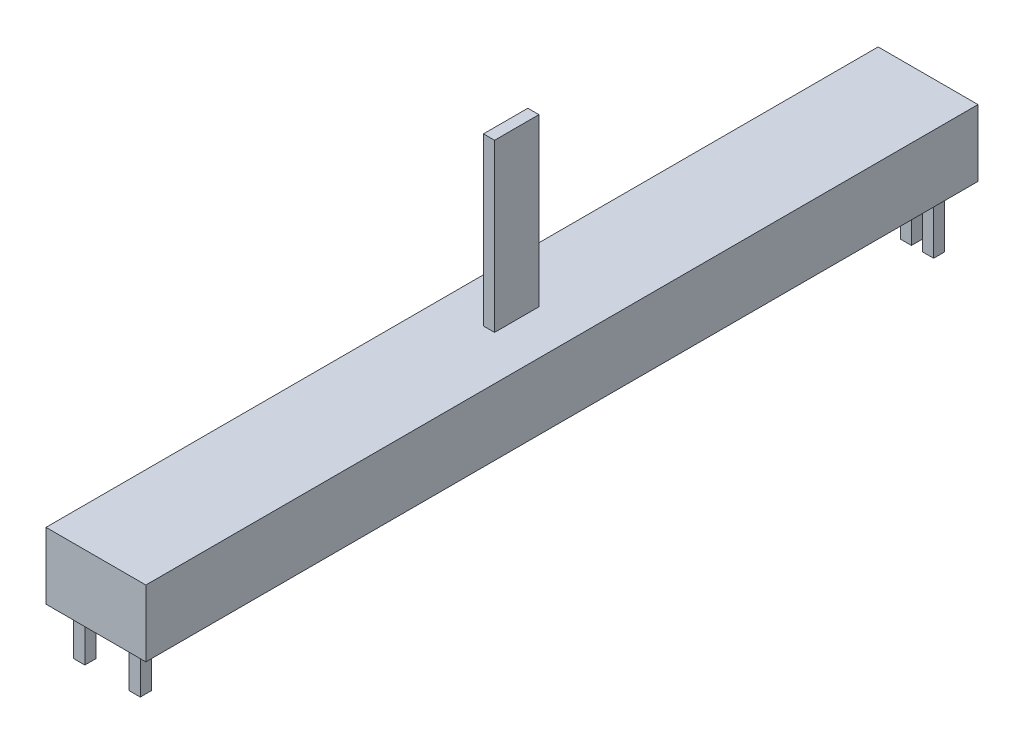
ISO-10303-21;
HEADER;
FILE_DESCRIPTION(('STEP AP214'),'2;1');
FILE_NAME('part.step','',(''),(''),'','','');
FILE_SCHEMA(('AUTOMOTIVE_DESIGN { 1 0 10303 214 1 1 1 1 }'));
ENDSEC;
DATA;
#1=APPLICATION_CONTEXT('core data for automotive mechanical design processes');
#2=APPLICATION_PROTOCOL_DEFINITION('international standard','automotive_design',2000,#1);
#3=PRODUCT_CONTEXT('',#1,'mechanical');
#4=PRODUCT('Part','Part','',(#3));
#5=PRODUCT_RELATED_PRODUCT_CATEGORY('part','',(#4));
#6=PRODUCT_DEFINITION_FORMATION('','',#4);
#7=PRODUCT_DEFINITION_CONTEXT('part definition',#1,'design');
#8=PRODUCT_DEFINITION('design','',#6,#7);
#9=PRODUCT_DEFINITION_SHAPE('','',#8);
#10=(LENGTH_UNIT() NAMED_UNIT(*) SI_UNIT(.MILLI.,.METRE.));
#11=(NAMED_UNIT(*) PLANE_ANGLE_UNIT() SI_UNIT($,.RADIAN.));
#12=(NAMED_UNIT(*) SI_UNIT($,.STERADIAN.) SOLID_ANGLE_UNIT());
#13=UNCERTAINTY_MEASURE_WITH_UNIT(LENGTH_MEASURE(1.E-05),#10,'distance_accuracy_value','');
#14=(GEOMETRIC_REPRESENTATION_CONTEXT(3) GLOBAL_UNCERTAINTY_ASSIGNED_CONTEXT((#13)) GLOBAL_UNIT_ASSIGNED_CONTEXT((#10,
#11,#12)) REPRESENTATION_CONTEXT('',''));
#15=CARTESIAN_POINT('',(0.,0.,0.));
#16=DIRECTION('',(0.,0.,1.));
#17=DIRECTION('',(1.,0.,0.));
#18=AXIS2_PLACEMENT_3D('',#15,#16,#17);
#19=CARTESIAN_POINT('',(0.,0.,0.));
#20=DIRECTION('',(0.,-1.,0.));
#21=DIRECTION('',(0.,0.,-1.));
#22=AXIS2_PLACEMENT_3D('',#19,#20,#21);
#23=PLANE('',#22);
#24=DIRECTION('',(0.,0.,-1.));
#25=VECTOR('',#24,1.);
#26=CARTESIAN_POINT('',(4.5,0.,37.5));
#27=LINE('',#26,#25);
#28=CARTESIAN_POINT('',(4.5,0.,37.5));
#29=VERTEX_POINT('',#28);
#30=CARTESIAN_POINT('',(4.5,0.,-37.5));
#31=VERTEX_POINT('',#30);
#32=EDGE_CURVE('E533',#29,#31,#27,.T.);
#33=ORIENTED_EDGE('',*,*,#32,.F.);
#34=DIRECTION('',(1.,0.,0.));
#35=VECTOR('',#34,1.);
#36=CARTESIAN_POINT('',(-4.5,0.,37.5));
#37=LINE('',#36,#35);
#38=CARTESIAN_POINT('',(-4.5,0.,37.5));
#39=VERTEX_POINT('',#38);
#40=EDGE_CURVE('E539',#39,#29,#37,.T.);
#41=ORIENTED_EDGE('',*,*,#40,.F.);
#42=DIRECTION('',(0.,0.,1.));
#43=VECTOR('',#42,1.);
#44=CARTESIAN_POINT('',(-4.5,0.,37.5));
#45=LINE('',#44,#43);
#46=CARTESIAN_POINT('',(-4.5,0.,-37.5));
#47=VERTEX_POINT('',#46);
#48=EDGE_CURVE('E555',#47,#39,#45,.T.);
#49=ORIENTED_EDGE('',*,*,#48,.F.);
#50=DIRECTION('',(-1.,0.,0.));
#51=VECTOR('',#50,1.);
#52=CARTESIAN_POINT('',(-4.5,0.,-37.5));
#53=LINE('',#52,#51);
#54=EDGE_CURVE('E552',#31,#47,#53,.T.);
#55=ORIENTED_EDGE('',*,*,#54,.F.);
#56=EDGE_LOOP('',(#33,#41,#49,#55));
#57=FACE_BOUND('',#56,.T.);
#58=DIRECTION('',(1.,0.,0.));
#59=VECTOR('',#58,1.);
#60=CARTESIAN_POINT('',(-4.,0.,34.5));
#61=LINE('',#60,#59);
#62=CARTESIAN_POINT('',(-4.,0.,34.5));
#63=VERTEX_POINT('',#62);
#64=CARTESIAN_POINT('',(-3.,0.,34.5));
#65=VERTEX_POINT('',#64);
#66=EDGE_CURVE('E466',#63,#65,#61,.T.);
#67=ORIENTED_EDGE('',*,*,#66,.F.);
#68=DIRECTION('',(0.,0.,-1.));
#69=VECTOR('',#68,1.);
#70=CARTESIAN_POINT('',(-4.,0.,35.5));
#71=LINE('',#70,#69);
#72=CARTESIAN_POINT('',(-4.,0.,35.5));
#73=VERTEX_POINT('',#72);
#74=EDGE_CURVE('E447',#73,#63,#71,.T.);
#75=ORIENTED_EDGE('',*,*,#74,.F.);
#76=DIRECTION('',(-1.,0.,0.));
#77=VECTOR('',#76,1.);
#78=CARTESIAN_POINT('',(-4.,0.,35.5));
#79=LINE('',#78,#77);
#80=CARTESIAN_POINT('',(-3.,0.,35.5));
#81=VERTEX_POINT('',#80);
#82=EDGE_CURVE('E453',#81,#73,#79,.T.);
#83=ORIENTED_EDGE('',*,*,#82,.F.);
#84=DIRECTION('',(0.,0.,1.));
#85=VECTOR('',#84,1.);
#86=CARTESIAN_POINT('',(-3.,0.,35.5));
#87=LINE('',#86,#85);
#88=EDGE_CURVE('E469',#65,#81,#87,.T.);
#89=ORIENTED_EDGE('',*,*,#88,.F.);
#90=EDGE_LOOP('',(#67,#75,#83,#89));
#91=FACE_BOUND('',#90,.T.);
#92=DIRECTION('',(1.,0.,0.));
#93=VECTOR('',#92,1.);
#94=CARTESIAN_POINT('',(1.,0.,34.5));
#95=LINE('',#94,#93);
#96=CARTESIAN_POINT('',(1.,0.,34.5));
#97=VERTEX_POINT('',#96);
#98=CARTESIAN_POINT('',(2.,0.,34.5));
#99=VERTEX_POINT('',#98);
#100=EDGE_CURVE('E425',#97,#99,#95,.T.);
#101=ORIENTED_EDGE('',*,*,#100,.F.);
#102=DIRECTION('',(0.,0.,-1.));
#103=VECTOR('',#102,1.);
#104=CARTESIAN_POINT('',(1.,0.,35.5));
#105=LINE('',#104,#103);
#106=CARTESIAN_POINT('',(1.,0.,35.5));
#107=VERTEX_POINT('',#106);
#108=EDGE_CURVE('E406',#107,#97,#105,.T.);
#109=ORIENTED_EDGE('',*,*,#108,.F.);
#110=DIRECTION('',(-1.,0.,0.));
#111=VECTOR('',#110,1.);
#112=CARTESIAN_POINT('',(1.,0.,35.5));
#113=LINE('',#112,#111);
#114=CARTESIAN_POINT('',(2.,0.,35.5));
#115=VERTEX_POINT('',#114);
#116=EDGE_CURVE('E412',#115,#107,#113,.T.);
#117=ORIENTED_EDGE('',*,*,#116,.F.);
#118=DIRECTION('',(0.,0.,1.));
#119=VECTOR('',#118,1.);
#120=CARTESIAN_POINT('',(2.,0.,35.5));
#121=LINE('',#120,#119);
#122=EDGE_CURVE('E428',#99,#115,#121,.T.);
#123=ORIENTED_EDGE('',*,*,#122,.F.);
#124=EDGE_LOOP('',(#101,#109,#117,#123));
#125=FACE_BOUND('',#124,.T.);
#126=DIRECTION('',(1.,0.,0.));
#127=VECTOR('',#126,1.);
#128=CARTESIAN_POINT('',(-3.5,0.,-35.5));
#129=LINE('',#128,#127);
#130=CARTESIAN_POINT('',(-3.5,0.,-35.5));
#131=VERTEX_POINT('',#130);
#132=CARTESIAN_POINT('',(-2.5,0.,-35.5));
#133=VERTEX_POINT('',#132);
#134=EDGE_CURVE('E384',#131,#133,#129,.T.);
#135=ORIENTED_EDGE('',*,*,#134,.F.);
#136=DIRECTION('',(0.,0.,-1.));
#137=VECTOR('',#136,1.);
#138=CARTESIAN_POINT('',(-3.5,0.,-35.5));
#139=LINE('',#138,#137);
#140=CARTESIAN_POINT('',(-3.5,0.,-34.5));
#141=VERTEX_POINT('',#140);
#142=EDGE_CURVE('E365',#141,#131,#139,.T.);
#143=ORIENTED_EDGE('',*,*,#142,.F.);
#144=DIRECTION('',(-1.,0.,0.));
#145=VECTOR('',#144,1.);
#146=CARTESIAN_POINT('',(-3.5,0.,-34.5));
#147=LINE('',#146,#145);
#148=CARTESIAN_POINT('',(-2.5,0.,-34.5));
#149=VERTEX_POINT('',#148);
#150=EDGE_CURVE('E371',#149,#141,#147,.T.);
#151=ORIENTED_EDGE('',*,*,#150,.F.);
#152=DIRECTION('',(0.,0.,1.));
#153=VECTOR('',#152,1.);
#154=CARTESIAN_POINT('',(-2.5,0.,-35.5));
#155=LINE('',#154,#153);
#156=EDGE_CURVE('E387',#133,#149,#155,.T.);
#157=ORIENTED_EDGE('',*,*,#156,.F.);
#158=EDGE_LOOP('',(#135,#143,#151,#157));
#159=FACE_BOUND('',#158,.T.);
#160=DIRECTION('',(1.,0.,0.));
#161=VECTOR('',#160,1.);
#162=CARTESIAN_POINT('',(-1.5,0.,-35.5));
#163=LINE('',#162,#161);
#164=CARTESIAN_POINT('',(-1.5,0.,-35.5));
#165=VERTEX_POINT('',#164);
#166=CARTESIAN_POINT('',(-0.500000000000002,0.,-35.5));
#167=VERTEX_POINT('',#166);
#168=EDGE_CURVE('E343',#165,#167,#163,.T.);
#169=ORIENTED_EDGE('',*,*,#168,.F.);
#170=DIRECTION('',(0.,0.,-1.));
#171=VECTOR('',#170,1.);
#172=CARTESIAN_POINT('',(-1.5,0.,-35.5));
#173=LINE('',#172,#171);
#174=CARTESIAN_POINT('',(-1.5,0.,-34.5));
#175=VERTEX_POINT('',#174);
#176=EDGE_CURVE('E324',#175,#165,#173,.T.);
#177=ORIENTED_EDGE('',*,*,#176,.F.);
#178=DIRECTION('',(-1.,0.,0.));
#179=VECTOR('',#178,1.);
#180=CARTESIAN_POINT('',(-1.5,0.,-34.5));
#181=LINE('',#180,#179);
#182=CARTESIAN_POINT('',(-0.500000000000002,0.,-34.5));
#183=VERTEX_POINT('',#182);
#184=EDGE_CURVE('E330',#183,#175,#181,.T.);
#185=ORIENTED_EDGE('',*,*,#184,.F.);
#186=DIRECTION('',(0.,0.,1.));
#187=VECTOR('',#186,1.);
#188=CARTESIAN_POINT('',(-0.500000000000002,0.,-35.5));
#189=LINE('',#188,#187);
#190=EDGE_CURVE('E346',#167,#183,#189,.T.);
#191=ORIENTED_EDGE('',*,*,#190,.F.);
#192=EDGE_LOOP('',(#169,#177,#185,#191));
#193=FACE_BOUND('',#192,.T.);
#194=DIRECTION('',(1.,0.,0.));
#195=VECTOR('',#194,1.);
#196=CARTESIAN_POINT('',(0.499999999999999,0.,-35.5));
#197=LINE('',#196,#195);
#198=CARTESIAN_POINT('',(0.499999999999999,0.,-35.5));
#199=VERTEX_POINT('',#198);
#200=CARTESIAN_POINT('',(1.5,0.,-35.5));
#201=VERTEX_POINT('',#200);
#202=EDGE_CURVE('E285',#199,#201,#197,.T.);
#203=ORIENTED_EDGE('',*,*,#202,.F.);
#204=DIRECTION('',(0.,0.,-1.));
#205=VECTOR('',#204,1.);
#206=CARTESIAN_POINT('',(0.499999999999999,0.,-35.5));
#207=LINE('',#206,#205);
#208=CARTESIAN_POINT('',(0.499999999999999,0.,-34.5));
#209=VERTEX_POINT('',#208);
#210=EDGE_CURVE('E280',#209,#199,#207,.T.);
#211=ORIENTED_EDGE('',*,*,#210,.F.);
#212=DIRECTION('',(-1.,0.,0.));
#213=VECTOR('',#212,1.);
#214=CARTESIAN_POINT('',(0.499999999999999,0.,-34.5));
#215=LINE('',#214,#213);
#216=CARTESIAN_POINT('',(1.5,0.,-34.5));
#217=VERTEX_POINT('',#216);
#218=EDGE_CURVE('E295',#217,#209,#215,.T.);
#219=ORIENTED_EDGE('',*,*,#218,.F.);
#220=DIRECTION('',(0.,0.,1.));
#221=VECTOR('',#220,1.);
#222=CARTESIAN_POINT('',(1.5,0.,-35.5));
#223=LINE('',#222,#221);
#224=EDGE_CURVE('E307',#201,#217,#223,.T.);
#225=ORIENTED_EDGE('',*,*,#224,.F.);
#226=EDGE_LOOP('',(#203,#211,#219,#225));
#227=FACE_BOUND('',#226,.T.);
#228=DIRECTION('',(1.,0.,0.));
#229=VECTOR('',#228,1.);
#230=CARTESIAN_POINT('',(2.5,0.,-35.5));
#231=LINE('',#230,#229);
#232=CARTESIAN_POINT('',(2.5,0.,-35.5));
#233=VERTEX_POINT('',#232);
#234=CARTESIAN_POINT('',(3.5,0.,-35.5));
#235=VERTEX_POINT('',#234);
#236=EDGE_CURVE('E999',#233,#235,#231,.T.);
#237=ORIENTED_EDGE('',*,*,#236,.F.);
#238=DIRECTION('',(0.,0.,-1.));
#239=VECTOR('',#238,1.);
#240=CARTESIAN_POINT('',(2.5,0.,-35.5));
#241=LINE('',#240,#239);
#242=CARTESIAN_POINT('',(2.5,0.,-34.5));
#243=VERTEX_POINT('',#242);
#244=EDGE_CURVE('E277',#243,#233,#241,.T.);
#245=ORIENTED_EDGE('',*,*,#244,.F.);
#246=DIRECTION('',(-1.,0.,0.));
#247=VECTOR('',#246,1.);
#248=CARTESIAN_POINT('',(2.5,0.,-34.5));
#249=LINE('',#248,#247);
#250=CARTESIAN_POINT('',(3.5,0.,-34.5));
#251=VERTEX_POINT('',#250);
#252=EDGE_CURVE('E273',#251,#243,#249,.T.);
#253=ORIENTED_EDGE('',*,*,#252,.F.);
#254=DIRECTION('',(0.,0.,1.));
#255=VECTOR('',#254,1.);
#256=CARTESIAN_POINT('',(3.5,0.,-35.5));
#257=LINE('',#256,#255);
#258=EDGE_CURVE('E995',#235,#251,#257,.T.);
#259=ORIENTED_EDGE('',*,*,#258,.F.);
#260=EDGE_LOOP('',(#237,#245,#253,#259));
#261=FACE_BOUND('',#260,.T.);
#262=ADVANCED_FACE('F41',(#57,#91,#125,#159,#193,#227,#261),#23,.T.);
#263=CARTESIAN_POINT('',(0.,6.,0.));
#264=DIRECTION('',(0.,-1.,0.));
#265=DIRECTION('',(0.,0.,-1.));
#266=AXIS2_PLACEMENT_3D('',#263,#264,#265);
#267=PLANE('',#266);
#268=DIRECTION('',(0.,0.,-1.));
#269=VECTOR('',#268,1.);
#270=CARTESIAN_POINT('',(4.5,6.,37.5));
#271=LINE('',#270,#269);
#272=CARTESIAN_POINT('',(4.5,6.,37.5));
#273=VERTEX_POINT('',#272);
#274=CARTESIAN_POINT('',(4.5,6.,-37.5));
#275=VERTEX_POINT('',#274);
#276=EDGE_CURVE('E534',#273,#275,#271,.T.);
#277=ORIENTED_EDGE('',*,*,#276,.T.);
#278=DIRECTION('',(-1.,0.,0.));
#279=VECTOR('',#278,1.);
#280=CARTESIAN_POINT('',(-4.5,6.,-37.5));
#281=LINE('',#280,#279);
#282=CARTESIAN_POINT('',(-4.5,6.,-37.5));
#283=VERTEX_POINT('',#282);
#284=EDGE_CURVE('E538',#275,#283,#281,.T.);
#285=ORIENTED_EDGE('',*,*,#284,.T.);
#286=DIRECTION('',(0.,0.,1.));
#287=VECTOR('',#286,1.);
#288=CARTESIAN_POINT('',(-4.5,6.,37.5));
#289=LINE('',#288,#287);
#290=CARTESIAN_POINT('',(-4.5,6.,37.5));
#291=VERTEX_POINT('',#290);
#292=EDGE_CURVE('E542',#283,#291,#289,.T.);
#293=ORIENTED_EDGE('',*,*,#292,.T.);
#294=DIRECTION('',(1.,0.,0.));
#295=VECTOR('',#294,1.);
#296=CARTESIAN_POINT('',(-4.5,6.,37.5));
#297=LINE('',#296,#295);
#298=EDGE_CURVE('E545',#291,#273,#297,.T.);
#299=ORIENTED_EDGE('',*,*,#298,.T.);
#300=EDGE_LOOP('',(#277,#285,#293,#299));
#301=FACE_BOUND('',#300,.T.);
#302=DIRECTION('',(0.,0.,1.));
#303=VECTOR('',#302,1.);
#304=CARTESIAN_POINT('',(-0.499999999999996,6.,2.07166864621877));
#305=LINE('',#304,#303);
#306=CARTESIAN_POINT('',(-0.499999999999996,6.,-1.92833135378123));
#307=VERTEX_POINT('',#306);
#308=CARTESIAN_POINT('',(-0.499999999999996,6.,2.07166864621877));
#309=VERTEX_POINT('',#308);
#310=EDGE_CURVE('E488',#307,#309,#305,.T.);
#311=ORIENTED_EDGE('',*,*,#310,.F.);
#312=DIRECTION('',(-1.,0.,0.));
#313=VECTOR('',#312,1.);
#314=CARTESIAN_POINT('',(-0.499999999999996,6.,-1.92833135378123));
#315=LINE('',#314,#313);
#316=CARTESIAN_POINT('',(0.500000000000004,6.,-1.92833135378123));
#317=VERTEX_POINT('',#316);
#318=EDGE_CURVE('E494',#317,#307,#315,.T.);
#319=ORIENTED_EDGE('',*,*,#318,.F.);
#320=DIRECTION('',(0.,0.,-1.));
#321=VECTOR('',#320,1.);
#322=CARTESIAN_POINT('',(0.500000000000006,6.,2.07166864621877));
#323=LINE('',#322,#321);
#324=CARTESIAN_POINT('',(0.500000000000006,6.,2.07166864621877));
#325=VERTEX_POINT('',#324);
#326=EDGE_CURVE('E511',#325,#317,#323,.T.);
#327=ORIENTED_EDGE('',*,*,#326,.F.);
#328=DIRECTION('',(1.,0.,0.));
#329=VECTOR('',#328,1.);
#330=CARTESIAN_POINT('',(-0.499999999999996,6.,2.07166864621877));
#331=LINE('',#330,#329);
#332=EDGE_CURVE('E507',#309,#325,#331,.T.);
#333=ORIENTED_EDGE('',*,*,#332,.F.);
#334=EDGE_LOOP('',(#311,#319,#327,#333));
#335=FACE_BOUND('',#334,.T.);
#336=ADVANCED_FACE('F587',(#301,#335),#267,.F.);
#337=CARTESIAN_POINT('',(4.5,6.,37.5));
#338=DIRECTION('',(-1.,0.,0.));
#339=DIRECTION('',(0.,0.,1.));
#340=AXIS2_PLACEMENT_3D('',#337,#338,#339);
#341=PLANE('',#340);
#342=ORIENTED_EDGE('',*,*,#32,.T.);
#343=DIRECTION('',(0.,-1.,0.));
#344=VECTOR('',#343,1.);
#345=CARTESIAN_POINT('',(4.5,6.,-37.5));
#346=LINE('',#345,#344);
#347=EDGE_CURVE('E11',#275,#31,#346,.T.);
#348=ORIENTED_EDGE('',*,*,#347,.F.);
#349=ORIENTED_EDGE('',*,*,#276,.F.);
#350=DIRECTION('',(0.,-1.,0.));
#351=VECTOR('',#350,1.);
#352=CARTESIAN_POINT('',(4.5,6.,37.5));
#353=LINE('',#352,#351);
#354=EDGE_CURVE('E548',#273,#29,#353,.T.);
#355=ORIENTED_EDGE('',*,*,#354,.T.);
#356=EDGE_LOOP('',(#342,#348,#349,#355));
#357=FACE_BOUND('',#356,.T.);
#358=ADVANCED_FACE('F43',(#357),#341,.F.);
#359=CARTESIAN_POINT('',(-4.5,6.,-37.5));
#360=DIRECTION('',(0.,0.,1.));
#361=DIRECTION('',(1.,0.,0.));
#362=AXIS2_PLACEMENT_3D('',#359,#360,#361);
#363=PLANE('',#362);
#364=ORIENTED_EDGE('',*,*,#54,.T.);
#365=DIRECTION('',(0.,-1.,0.));
#366=VECTOR('',#365,1.);
#367=CARTESIAN_POINT('',(-4.5,6.,-37.5));
#368=LINE('',#367,#366);
#369=EDGE_CURVE('E50',#283,#47,#368,.T.);
#370=ORIENTED_EDGE('',*,*,#369,.F.);
#371=ORIENTED_EDGE('',*,*,#284,.F.);
#372=ORIENTED_EDGE('',*,*,#347,.T.);
#373=EDGE_LOOP('',(#364,#370,#371,#372));
#374=FACE_BOUND('',#373,.T.);
#375=ADVANCED_FACE('F589',(#374),#363,.F.);
#376=CARTESIAN_POINT('',(-4.5,6.,37.5));
#377=DIRECTION('',(1.,0.,0.));
#378=DIRECTION('',(0.,0.,-1.));
#379=AXIS2_PLACEMENT_3D('',#376,#377,#378);
#380=PLANE('',#379);
#381=ORIENTED_EDGE('',*,*,#48,.T.);
#382=DIRECTION('',(0.,-1.,0.));
#383=VECTOR('',#382,1.);
#384=CARTESIAN_POINT('',(-4.5,6.,37.5));
#385=LINE('',#384,#383);
#386=EDGE_CURVE('E563',#291,#39,#385,.T.);
#387=ORIENTED_EDGE('',*,*,#386,.F.);
#388=ORIENTED_EDGE('',*,*,#292,.F.);
#389=ORIENTED_EDGE('',*,*,#369,.T.);
#390=EDGE_LOOP('',(#381,#387,#388,#389));
#391=FACE_BOUND('',#390,.T.);
#392=ADVANCED_FACE('F572',(#391),#380,.F.);
#393=CARTESIAN_POINT('',(-4.5,6.,37.5));
#394=DIRECTION('',(0.,0.,-1.));
#395=DIRECTION('',(-1.,0.,0.));
#396=AXIS2_PLACEMENT_3D('',#393,#394,#395);
#397=PLANE('',#396);
#398=ORIENTED_EDGE('',*,*,#40,.T.);
#399=ORIENTED_EDGE('',*,*,#354,.F.);
#400=ORIENTED_EDGE('',*,*,#298,.F.);
#401=ORIENTED_EDGE('',*,*,#386,.T.);
#402=EDGE_LOOP('',(#398,#399,#400,#401));
#403=FACE_BOUND('',#402,.T.);
#404=ADVANCED_FACE('F581',(#403),#397,.F.);
#405=CARTESIAN_POINT('',(-0.499999999999996,21.,2.07166864621877));
#406=DIRECTION('',(1.,0.,0.));
#407=DIRECTION('',(0.,0.,-1.));
#408=AXIS2_PLACEMENT_3D('',#405,#406,#407);
#409=PLANE('',#408);
#410=ORIENTED_EDGE('',*,*,#310,.T.);
#411=DIRECTION('',(0.,-1.,0.));
#412=VECTOR('',#411,1.);
#413=CARTESIAN_POINT('',(-0.499999999999996,21.,2.07166864621877));
#414=LINE('',#413,#412);
#415=CARTESIAN_POINT('',(-0.499999999999996,21.,2.07166864621877));
#416=VERTEX_POINT('',#415);
#417=EDGE_CURVE('E529',#416,#309,#414,.T.);
#418=ORIENTED_EDGE('',*,*,#417,.F.);
#419=DIRECTION('',(0.,0.,1.));
#420=VECTOR('',#419,1.);
#421=CARTESIAN_POINT('',(-0.499999999999996,21.,2.07166864621877));
#422=LINE('',#421,#420);
#423=CARTESIAN_POINT('',(-0.499999999999996,21.,-1.92833135378123));
#424=VERTEX_POINT('',#423);
#425=EDGE_CURVE('E489',#424,#416,#422,.T.);
#426=ORIENTED_EDGE('',*,*,#425,.F.);
#427=DIRECTION('',(0.,-1.,0.));
#428=VECTOR('',#427,1.);
#429=CARTESIAN_POINT('',(-0.499999999999996,21.,-1.92833135378123));
#430=LINE('',#429,#428);
#431=EDGE_CURVE('E503',#424,#307,#430,.T.);
#432=ORIENTED_EDGE('',*,*,#431,.T.);
#433=EDGE_LOOP('',(#410,#418,#426,#432));
#434=FACE_BOUND('',#433,.T.);
#435=ADVANCED_FACE('F605',(#434),#409,.F.);
#436=CARTESIAN_POINT('',(-0.499999999999996,21.,2.07166864621877));
#437=DIRECTION('',(0.,0.,-1.));
#438=DIRECTION('',(-1.,0.,0.));
#439=AXIS2_PLACEMENT_3D('',#436,#437,#438);
#440=PLANE('',#439);
#441=ORIENTED_EDGE('',*,*,#332,.T.);
#442=DIRECTION('',(0.,-1.,0.));
#443=VECTOR('',#442,1.);
#444=CARTESIAN_POINT('',(0.500000000000006,21.,2.07166864621877));
#445=LINE('',#444,#443);
#446=CARTESIAN_POINT('',(0.500000000000006,21.,2.07166864621877));
#447=VERTEX_POINT('',#446);
#448=EDGE_CURVE('E525',#447,#325,#445,.T.);
#449=ORIENTED_EDGE('',*,*,#448,.F.);
#450=DIRECTION('',(1.,0.,0.));
#451=VECTOR('',#450,1.);
#452=CARTESIAN_POINT('',(-0.499999999999996,21.,2.07166864621877));
#453=LINE('',#452,#451);
#454=EDGE_CURVE('E493',#416,#447,#453,.T.);
#455=ORIENTED_EDGE('',*,*,#454,.F.);
#456=ORIENTED_EDGE('',*,*,#417,.T.);
#457=EDGE_LOOP('',(#441,#449,#455,#456));
#458=FACE_BOUND('',#457,.T.);
#459=ADVANCED_FACE('F609',(#458),#440,.F.);
#460=CARTESIAN_POINT('',(0.500000000000006,21.,2.07166864621877));
#461=DIRECTION('',(-1.,0.,0.));
#462=DIRECTION('',(0.,0.,1.));
#463=AXIS2_PLACEMENT_3D('',#460,#461,#462);
#464=PLANE('',#463);
#465=ORIENTED_EDGE('',*,*,#326,.T.);
#466=DIRECTION('',(0.,-1.,0.));
#467=VECTOR('',#466,1.);
#468=CARTESIAN_POINT('',(0.500000000000004,21.,-1.92833135378123));
#469=LINE('',#468,#467);
#470=CARTESIAN_POINT('',(0.500000000000004,21.,-1.92833135378123));
#471=VERTEX_POINT('',#470);
#472=EDGE_CURVE('E521',#471,#317,#469,.T.);
#473=ORIENTED_EDGE('',*,*,#472,.F.);
#474=DIRECTION('',(0.,0.,-1.));
#475=VECTOR('',#474,1.);
#476=CARTESIAN_POINT('',(0.500000000000006,21.,2.07166864621877));
#477=LINE('',#476,#475);
#478=EDGE_CURVE('E497',#447,#471,#477,.T.);
#479=ORIENTED_EDGE('',*,*,#478,.F.);
#480=ORIENTED_EDGE('',*,*,#448,.T.);
#481=EDGE_LOOP('',(#465,#473,#479,#480));
#482=FACE_BOUND('',#481,.T.);
#483=ADVANCED_FACE('F614',(#482),#464,.F.);
#484=CARTESIAN_POINT('',(-0.499999999999996,21.,-1.92833135378123));
#485=DIRECTION('',(0.,0.,1.));
#486=DIRECTION('',(1.,0.,0.));
#487=AXIS2_PLACEMENT_3D('',#484,#485,#486);
#488=PLANE('',#487);
#489=ORIENTED_EDGE('',*,*,#318,.T.);
#490=ORIENTED_EDGE('',*,*,#431,.F.);
#491=DIRECTION('',(-1.,0.,0.));
#492=VECTOR('',#491,1.);
#493=CARTESIAN_POINT('',(-0.499999999999996,21.,-1.92833135378123));
#494=LINE('',#493,#492);
#495=EDGE_CURVE('E500',#471,#424,#494,.T.);
#496=ORIENTED_EDGE('',*,*,#495,.F.);
#497=ORIENTED_EDGE('',*,*,#472,.T.);
#498=EDGE_LOOP('',(#489,#490,#496,#497));
#499=FACE_BOUND('',#498,.T.);
#500=ADVANCED_FACE('F620',(#499),#488,.F.);
#501=CARTESIAN_POINT('',(0.,21.,0.));
#502=DIRECTION('',(0.,-1.,0.));
#503=DIRECTION('',(0.,0.,-1.));
#504=AXIS2_PLACEMENT_3D('',#501,#502,#503);
#505=PLANE('',#504);
#506=ORIENTED_EDGE('',*,*,#425,.T.);
#507=ORIENTED_EDGE('',*,*,#454,.T.);
#508=ORIENTED_EDGE('',*,*,#478,.T.);
#509=ORIENTED_EDGE('',*,*,#495,.T.);
#510=EDGE_LOOP('',(#506,#507,#508,#509));
#511=FACE_BOUND('',#510,.T.);
#512=ADVANCED_FACE('F624',(#511),#505,.F.);
#513=CARTESIAN_POINT('',(-4.,-5.,35.5));
#514=DIRECTION('',(1.,0.,0.));
#515=DIRECTION('',(0.,0.,-1.));
#516=AXIS2_PLACEMENT_3D('',#513,#514,#515);
#517=PLANE('',#516);
#518=ORIENTED_EDGE('',*,*,#74,.T.);
#519=DIRECTION('',(0.,1.,0.));
#520=VECTOR('',#519,1.);
#521=CARTESIAN_POINT('',(-4.,-5.,34.5));
#522=LINE('',#521,#520);
#523=CARTESIAN_POINT('',(-4.,-5.,34.5));
#524=VERTEX_POINT('',#523);
#525=EDGE_CURVE('E485',#524,#63,#522,.T.);
#526=ORIENTED_EDGE('',*,*,#525,.F.);
#527=DIRECTION('',(0.,0.,-1.));
#528=VECTOR('',#527,1.);
#529=CARTESIAN_POINT('',(-4.,-5.,35.5));
#530=LINE('',#529,#528);
#531=CARTESIAN_POINT('',(-4.,-5.,35.5));
#532=VERTEX_POINT('',#531);
#533=EDGE_CURVE('E448',#532,#524,#530,.T.);
#534=ORIENTED_EDGE('',*,*,#533,.F.);
#535=DIRECTION('',(0.,1.,0.));
#536=VECTOR('',#535,1.);
#537=CARTESIAN_POINT('',(-4.,-5.,35.5));
#538=LINE('',#537,#536);
#539=EDGE_CURVE('E462',#532,#73,#538,.T.);
#540=ORIENTED_EDGE('',*,*,#539,.T.);
#541=EDGE_LOOP('',(#518,#526,#534,#540));
#542=FACE_BOUND('',#541,.T.);
#543=ADVANCED_FACE('F628',(#542),#517,.F.);
#544=CARTESIAN_POINT('',(-4.,-5.,34.5));
#545=DIRECTION('',(0.,0.,1.));
#546=DIRECTION('',(1.,0.,0.));
#547=AXIS2_PLACEMENT_3D('',#544,#545,#546);
#548=PLANE('',#547);
#549=ORIENTED_EDGE('',*,*,#66,.T.);
#550=DIRECTION('',(0.,1.,0.));
#551=VECTOR('',#550,1.);
#552=CARTESIAN_POINT('',(-3.,-5.,34.5));
#553=LINE('',#552,#551);
#554=CARTESIAN_POINT('',(-3.,-5.,34.5));
#555=VERTEX_POINT('',#554);
#556=EDGE_CURVE('E481',#555,#65,#553,.T.);
#557=ORIENTED_EDGE('',*,*,#556,.F.);
#558=DIRECTION('',(1.,0.,0.));
#559=VECTOR('',#558,1.);
#560=CARTESIAN_POINT('',(-4.,-5.,34.5));
#561=LINE('',#560,#559);
#562=EDGE_CURVE('E452',#524,#555,#561,.T.);
#563=ORIENTED_EDGE('',*,*,#562,.F.);
#564=ORIENTED_EDGE('',*,*,#525,.T.);
#565=EDGE_LOOP('',(#549,#557,#563,#564));
#566=FACE_BOUND('',#565,.T.);
#567=ADVANCED_FACE('F632',(#566),#548,.F.);
#568=CARTESIAN_POINT('',(-3.,-5.,35.5));
#569=DIRECTION('',(-1.,0.,0.));
#570=DIRECTION('',(0.,0.,1.));
#571=AXIS2_PLACEMENT_3D('',#568,#569,#570);
#572=PLANE('',#571);
#573=ORIENTED_EDGE('',*,*,#88,.T.);
#574=DIRECTION('',(0.,1.,0.));
#575=VECTOR('',#574,1.);
#576=CARTESIAN_POINT('',(-3.,-5.,35.5));
#577=LINE('',#576,#575);
#578=CARTESIAN_POINT('',(-3.,-5.,35.5));
#579=VERTEX_POINT('',#578);
#580=EDGE_CURVE('E478',#579,#81,#577,.T.);
#581=ORIENTED_EDGE('',*,*,#580,.F.);
#582=DIRECTION('',(0.,0.,1.));
#583=VECTOR('',#582,1.);
#584=CARTESIAN_POINT('',(-3.,-5.,35.5));
#585=LINE('',#584,#583);
#586=EDGE_CURVE('E456',#555,#579,#585,.T.);
#587=ORIENTED_EDGE('',*,*,#586,.F.);
#588=ORIENTED_EDGE('',*,*,#556,.T.);
#589=EDGE_LOOP('',(#573,#581,#587,#588));
#590=FACE_BOUND('',#589,.T.);
#591=ADVANCED_FACE('F636',(#590),#572,.F.);
#592=CARTESIAN_POINT('',(-4.,-5.,35.5));
#593=DIRECTION('',(0.,0.,-1.));
#594=DIRECTION('',(-1.,0.,0.));
#595=AXIS2_PLACEMENT_3D('',#592,#593,#594);
#596=PLANE('',#595);
#597=ORIENTED_EDGE('',*,*,#82,.T.);
#598=ORIENTED_EDGE('',*,*,#539,.F.);
#599=DIRECTION('',(-1.,0.,0.));
#600=VECTOR('',#599,1.);
#601=CARTESIAN_POINT('',(-4.,-5.,35.5));
#602=LINE('',#601,#600);
#603=EDGE_CURVE('E459',#579,#532,#602,.T.);
#604=ORIENTED_EDGE('',*,*,#603,.F.);
#605=ORIENTED_EDGE('',*,*,#580,.T.);
#606=EDGE_LOOP('',(#597,#598,#604,#605));
#607=FACE_BOUND('',#606,.T.);
#608=ADVANCED_FACE('F640',(#607),#596,.F.);
#609=CARTESIAN_POINT('',(0.,-5.,0.));
#610=DIRECTION('',(0.,-1.,0.));
#611=DIRECTION('',(0.,0.,-1.));
#612=AXIS2_PLACEMENT_3D('',#609,#610,#611);
#613=PLANE('',#612);
#614=ORIENTED_EDGE('',*,*,#533,.T.);
#615=ORIENTED_EDGE('',*,*,#562,.T.);
#616=ORIENTED_EDGE('',*,*,#586,.T.);
#617=ORIENTED_EDGE('',*,*,#603,.T.);
#618=EDGE_LOOP('',(#614,#615,#616,#617));
#619=FACE_BOUND('',#618,.T.);
#620=ADVANCED_FACE('F644',(#619),#613,.T.);
#621=CARTESIAN_POINT('',(1.,-5.,35.5));
#622=DIRECTION('',(1.,0.,0.));
#623=DIRECTION('',(0.,0.,-1.));
#624=AXIS2_PLACEMENT_3D('',#621,#622,#623);
#625=PLANE('',#624);
#626=ORIENTED_EDGE('',*,*,#108,.T.);
#627=DIRECTION('',(0.,1.,0.));
#628=VECTOR('',#627,1.);
#629=CARTESIAN_POINT('',(1.,-5.,34.5));
#630=LINE('',#629,#628);
#631=CARTESIAN_POINT('',(1.,-5.,34.5));
#632=VERTEX_POINT('',#631);
#633=EDGE_CURVE('E444',#632,#97,#630,.T.);
#634=ORIENTED_EDGE('',*,*,#633,.F.);
#635=DIRECTION('',(0.,0.,-1.));
#636=VECTOR('',#635,1.);
#637=CARTESIAN_POINT('',(1.,-5.,35.5));
#638=LINE('',#637,#636);
#639=CARTESIAN_POINT('',(1.,-5.,35.5));
#640=VERTEX_POINT('',#639);
#641=EDGE_CURVE('E407',#640,#632,#638,.T.);
#642=ORIENTED_EDGE('',*,*,#641,.F.);
#643=DIRECTION('',(0.,1.,0.));
#644=VECTOR('',#643,1.);
#645=CARTESIAN_POINT('',(1.,-5.,35.5));
#646=LINE('',#645,#644);
#647=EDGE_CURVE('E421',#640,#107,#646,.T.);
#648=ORIENTED_EDGE('',*,*,#647,.T.);
#649=EDGE_LOOP('',(#626,#634,#642,#648));
#650=FACE_BOUND('',#649,.T.);
#651=ADVANCED_FACE('F648',(#650),#625,.F.);
#652=CARTESIAN_POINT('',(1.,-5.,34.5));
#653=DIRECTION('',(0.,0.,1.));
#654=DIRECTION('',(1.,0.,0.));
#655=AXIS2_PLACEMENT_3D('',#652,#653,#654);
#656=PLANE('',#655);
#657=ORIENTED_EDGE('',*,*,#100,.T.);
#658=DIRECTION('',(0.,1.,0.));
#659=VECTOR('',#658,1.);
#660=CARTESIAN_POINT('',(2.,-5.,34.5));
#661=LINE('',#660,#659);
#662=CARTESIAN_POINT('',(2.,-5.,34.5));
#663=VERTEX_POINT('',#662);
#664=EDGE_CURVE('E440',#663,#99,#661,.T.);
#665=ORIENTED_EDGE('',*,*,#664,.F.);
#666=DIRECTION('',(1.,0.,0.));
#667=VECTOR('',#666,1.);
#668=CARTESIAN_POINT('',(1.,-5.,34.5));
#669=LINE('',#668,#667);
#670=EDGE_CURVE('E411',#632,#663,#669,.T.);
#671=ORIENTED_EDGE('',*,*,#670,.F.);
#672=ORIENTED_EDGE('',*,*,#633,.T.);
#673=EDGE_LOOP('',(#657,#665,#671,#672));
#674=FACE_BOUND('',#673,.T.);
#675=ADVANCED_FACE('F652',(#674),#656,.F.);
#676=CARTESIAN_POINT('',(2.,-5.,35.5));
#677=DIRECTION('',(-1.,0.,0.));
#678=DIRECTION('',(0.,0.,1.));
#679=AXIS2_PLACEMENT_3D('',#676,#677,#678);
#680=PLANE('',#679);
#681=ORIENTED_EDGE('',*,*,#122,.T.);
#682=DIRECTION('',(0.,1.,0.));
#683=VECTOR('',#682,1.);
#684=CARTESIAN_POINT('',(2.,-5.,35.5));
#685=LINE('',#684,#683);
#686=CARTESIAN_POINT('',(2.,-5.,35.5));
#687=VERTEX_POINT('',#686);
#688=EDGE_CURVE('E437',#687,#115,#685,.T.);
#689=ORIENTED_EDGE('',*,*,#688,.F.);
#690=DIRECTION('',(0.,0.,1.));
#691=VECTOR('',#690,1.);
#692=CARTESIAN_POINT('',(2.,-5.,35.5));
#693=LINE('',#692,#691);
#694=EDGE_CURVE('E415',#663,#687,#693,.T.);
#695=ORIENTED_EDGE('',*,*,#694,.F.);
#696=ORIENTED_EDGE('',*,*,#664,.T.);
#697=EDGE_LOOP('',(#681,#689,#695,#696));
#698=FACE_BOUND('',#697,.T.);
#699=ADVANCED_FACE('F656',(#698),#680,.F.);
#700=CARTESIAN_POINT('',(1.,-5.,35.5));
#701=DIRECTION('',(0.,0.,-1.));
#702=DIRECTION('',(-1.,0.,0.));
#703=AXIS2_PLACEMENT_3D('',#700,#701,#702);
#704=PLANE('',#703);
#705=ORIENTED_EDGE('',*,*,#116,.T.);
#706=ORIENTED_EDGE('',*,*,#647,.F.);
#707=DIRECTION('',(-1.,0.,0.));
#708=VECTOR('',#707,1.);
#709=CARTESIAN_POINT('',(1.,-5.,35.5));
#710=LINE('',#709,#708);
#711=EDGE_CURVE('E418',#687,#640,#710,.T.);
#712=ORIENTED_EDGE('',*,*,#711,.F.);
#713=ORIENTED_EDGE('',*,*,#688,.T.);
#714=EDGE_LOOP('',(#705,#706,#712,#713));
#715=FACE_BOUND('',#714,.T.);
#716=ADVANCED_FACE('F660',(#715),#704,.F.);
#717=CARTESIAN_POINT('',(0.,-5.,0.));
#718=DIRECTION('',(0.,-1.,0.));
#719=DIRECTION('',(0.,0.,-1.));
#720=AXIS2_PLACEMENT_3D('',#717,#718,#719);
#721=PLANE('',#720);
#722=ORIENTED_EDGE('',*,*,#641,.T.);
#723=ORIENTED_EDGE('',*,*,#670,.T.);
#724=ORIENTED_EDGE('',*,*,#694,.T.);
#725=ORIENTED_EDGE('',*,*,#711,.T.);
#726=EDGE_LOOP('',(#722,#723,#724,#725));
#727=FACE_BOUND('',#726,.T.);
#728=ADVANCED_FACE('F664',(#727),#721,.T.);
#729=CARTESIAN_POINT('',(-3.5,-5.,-35.5));
#730=DIRECTION('',(1.,0.,0.));
#731=DIRECTION('',(0.,0.,-1.));
#732=AXIS2_PLACEMENT_3D('',#729,#730,#731);
#733=PLANE('',#732);
#734=ORIENTED_EDGE('',*,*,#142,.T.);
#735=DIRECTION('',(0.,1.,0.));
#736=VECTOR('',#735,1.);
#737=CARTESIAN_POINT('',(-3.5,-5.,-35.5));
#738=LINE('',#737,#736);
#739=CARTESIAN_POINT('',(-3.5,-5.,-35.5));
#740=VERTEX_POINT('',#739);
#741=EDGE_CURVE('E403',#740,#131,#738,.T.);
#742=ORIENTED_EDGE('',*,*,#741,.F.);
#743=DIRECTION('',(0.,0.,-1.));
#744=VECTOR('',#743,1.);
#745=CARTESIAN_POINT('',(-3.5,-5.,-35.5));
#746=LINE('',#745,#744);
#747=CARTESIAN_POINT('',(-3.5,-5.,-34.5));
#748=VERTEX_POINT('',#747);
#749=EDGE_CURVE('E366',#748,#740,#746,.T.);
#750=ORIENTED_EDGE('',*,*,#749,.F.);
#751=DIRECTION('',(0.,1.,0.));
#752=VECTOR('',#751,1.);
#753=CARTESIAN_POINT('',(-3.5,-5.,-34.5));
#754=LINE('',#753,#752);
#755=EDGE_CURVE('E380',#748,#141,#754,.T.);
#756=ORIENTED_EDGE('',*,*,#755,.T.);
#757=EDGE_LOOP('',(#734,#742,#750,#756));
#758=FACE_BOUND('',#757,.T.);
#759=ADVANCED_FACE('F668',(#758),#733,.F.);
#760=CARTESIAN_POINT('',(-3.5,-5.,-35.5));
#761=DIRECTION('',(0.,0.,1.));
#762=DIRECTION('',(1.,0.,0.));
#763=AXIS2_PLACEMENT_3D('',#760,#761,#762);
#764=PLANE('',#763);
#765=ORIENTED_EDGE('',*,*,#134,.T.);
#766=DIRECTION('',(0.,1.,0.));
#767=VECTOR('',#766,1.);
#768=CARTESIAN_POINT('',(-2.5,-5.,-35.5));
#769=LINE('',#768,#767);
#770=CARTESIAN_POINT('',(-2.5,-5.,-35.5));
#771=VERTEX_POINT('',#770);
#772=EDGE_CURVE('E399',#771,#133,#769,.T.);
#773=ORIENTED_EDGE('',*,*,#772,.F.);
#774=DIRECTION('',(1.,0.,0.));
#775=VECTOR('',#774,1.);
#776=CARTESIAN_POINT('',(-3.5,-5.,-35.5));
#777=LINE('',#776,#775);
#778=EDGE_CURVE('E370',#740,#771,#777,.T.);
#779=ORIENTED_EDGE('',*,*,#778,.F.);
#780=ORIENTED_EDGE('',*,*,#741,.T.);
#781=EDGE_LOOP('',(#765,#773,#779,#780));
#782=FACE_BOUND('',#781,.T.);
#783=ADVANCED_FACE('F672',(#782),#764,.F.);
#784=CARTESIAN_POINT('',(-2.5,-5.,-35.5));
#785=DIRECTION('',(-1.,0.,0.));
#786=DIRECTION('',(0.,0.,1.));
#787=AXIS2_PLACEMENT_3D('',#784,#785,#786);
#788=PLANE('',#787);
#789=ORIENTED_EDGE('',*,*,#156,.T.);
#790=DIRECTION('',(0.,1.,0.));
#791=VECTOR('',#790,1.);
#792=CARTESIAN_POINT('',(-2.5,-5.,-34.5));
#793=LINE('',#792,#791);
#794=CARTESIAN_POINT('',(-2.5,-5.,-34.5));
#795=VERTEX_POINT('',#794);
#796=EDGE_CURVE('E396',#795,#149,#793,.T.);
#797=ORIENTED_EDGE('',*,*,#796,.F.);
#798=DIRECTION('',(0.,0.,1.));
#799=VECTOR('',#798,1.);
#800=CARTESIAN_POINT('',(-2.5,-5.,-35.5));
#801=LINE('',#800,#799);
#802=EDGE_CURVE('E374',#771,#795,#801,.T.);
#803=ORIENTED_EDGE('',*,*,#802,.F.);
#804=ORIENTED_EDGE('',*,*,#772,.T.);
#805=EDGE_LOOP('',(#789,#797,#803,#804));
#806=FACE_BOUND('',#805,.T.);
#807=ADVANCED_FACE('F676',(#806),#788,.F.);
#808=CARTESIAN_POINT('',(-3.5,-5.,-34.5));
#809=DIRECTION('',(0.,0.,-1.));
#810=DIRECTION('',(-1.,0.,0.));
#811=AXIS2_PLACEMENT_3D('',#808,#809,#810);
#812=PLANE('',#811);
#813=ORIENTED_EDGE('',*,*,#150,.T.);
#814=ORIENTED_EDGE('',*,*,#755,.F.);
#815=DIRECTION('',(-1.,0.,0.));
#816=VECTOR('',#815,1.);
#817=CARTESIAN_POINT('',(-3.5,-5.,-34.5));
#818=LINE('',#817,#816);
#819=EDGE_CURVE('E377',#795,#748,#818,.T.);
#820=ORIENTED_EDGE('',*,*,#819,.F.);
#821=ORIENTED_EDGE('',*,*,#796,.T.);
#822=EDGE_LOOP('',(#813,#814,#820,#821));
#823=FACE_BOUND('',#822,.T.);
#824=ADVANCED_FACE('F680',(#823),#812,.F.);
#825=CARTESIAN_POINT('',(0.,-5.,0.));
#826=DIRECTION('',(0.,1.,0.));
#827=DIRECTION('',(0.,0.,1.));
#828=AXIS2_PLACEMENT_3D('',#825,#826,#827);
#829=PLANE('',#828);
#830=ORIENTED_EDGE('',*,*,#749,.T.);
#831=ORIENTED_EDGE('',*,*,#778,.T.);
#832=ORIENTED_EDGE('',*,*,#802,.T.);
#833=ORIENTED_EDGE('',*,*,#819,.T.);
#834=EDGE_LOOP('',(#830,#831,#832,#833));
#835=FACE_BOUND('',#834,.T.);
#836=ADVANCED_FACE('F684',(#835),#829,.F.);
#837=CARTESIAN_POINT('',(-1.5,-5.,-35.5));
#838=DIRECTION('',(1.,0.,0.));
#839=DIRECTION('',(0.,0.,-1.));
#840=AXIS2_PLACEMENT_3D('',#837,#838,#839);
#841=PLANE('',#840);
#842=ORIENTED_EDGE('',*,*,#176,.T.);
#843=DIRECTION('',(0.,1.,0.));
#844=VECTOR('',#843,1.);
#845=CARTESIAN_POINT('',(-1.5,-5.,-35.5));
#846=LINE('',#845,#844);
#847=CARTESIAN_POINT('',(-1.5,-5.,-35.5));
#848=VERTEX_POINT('',#847);
#849=EDGE_CURVE('E362',#848,#165,#846,.T.);
#850=ORIENTED_EDGE('',*,*,#849,.F.);
#851=DIRECTION('',(0.,0.,-1.));
#852=VECTOR('',#851,1.);
#853=CARTESIAN_POINT('',(-1.5,-5.,-35.5));
#854=LINE('',#853,#852);
#855=CARTESIAN_POINT('',(-1.5,-5.,-34.5));
#856=VERTEX_POINT('',#855);
#857=EDGE_CURVE('E325',#856,#848,#854,.T.);
#858=ORIENTED_EDGE('',*,*,#857,.F.);
#859=DIRECTION('',(0.,1.,0.));
#860=VECTOR('',#859,1.);
#861=CARTESIAN_POINT('',(-1.5,-5.,-34.5));
#862=LINE('',#861,#860);
#863=EDGE_CURVE('E339',#856,#175,#862,.T.);
#864=ORIENTED_EDGE('',*,*,#863,.T.);
#865=EDGE_LOOP('',(#842,#850,#858,#864));
#866=FACE_BOUND('',#865,.T.);
#867=ADVANCED_FACE('F688',(#866),#841,.F.);
#868=CARTESIAN_POINT('',(-1.5,-5.,-35.5));
#869=DIRECTION('',(0.,0.,1.));
#870=DIRECTION('',(1.,0.,0.));
#871=AXIS2_PLACEMENT_3D('',#868,#869,#870);
#872=PLANE('',#871);
#873=ORIENTED_EDGE('',*,*,#168,.T.);
#874=DIRECTION('',(0.,1.,0.));
#875=VECTOR('',#874,1.);
#876=CARTESIAN_POINT('',(-0.500000000000002,-5.,-35.5));
#877=LINE('',#876,#875);
#878=CARTESIAN_POINT('',(-0.500000000000002,-5.,-35.5));
#879=VERTEX_POINT('',#878);
#880=EDGE_CURVE('E358',#879,#167,#877,.T.);
#881=ORIENTED_EDGE('',*,*,#880,.F.);
#882=DIRECTION('',(1.,0.,0.));
#883=VECTOR('',#882,1.);
#884=CARTESIAN_POINT('',(-1.5,-5.,-35.5));
#885=LINE('',#884,#883);
#886=EDGE_CURVE('E329',#848,#879,#885,.T.);
#887=ORIENTED_EDGE('',*,*,#886,.F.);
#888=ORIENTED_EDGE('',*,*,#849,.T.);
#889=EDGE_LOOP('',(#873,#881,#887,#888));
#890=FACE_BOUND('',#889,.T.);
#891=ADVANCED_FACE('F692',(#890),#872,.F.);
#892=CARTESIAN_POINT('',(-0.500000000000002,-5.,-35.5));
#893=DIRECTION('',(-1.,0.,0.));
#894=DIRECTION('',(0.,0.,1.));
#895=AXIS2_PLACEMENT_3D('',#892,#893,#894);
#896=PLANE('',#895);
#897=ORIENTED_EDGE('',*,*,#190,.T.);
#898=DIRECTION('',(0.,1.,0.));
#899=VECTOR('',#898,1.);
#900=CARTESIAN_POINT('',(-0.500000000000002,-5.,-34.5));
#901=LINE('',#900,#899);
#902=CARTESIAN_POINT('',(-0.500000000000002,-5.,-34.5));
#903=VERTEX_POINT('',#902);
#904=EDGE_CURVE('E355',#903,#183,#901,.T.);
#905=ORIENTED_EDGE('',*,*,#904,.F.);
#906=DIRECTION('',(0.,0.,1.));
#907=VECTOR('',#906,1.);
#908=CARTESIAN_POINT('',(-0.500000000000002,-5.,-35.5));
#909=LINE('',#908,#907);
#910=EDGE_CURVE('E333',#879,#903,#909,.T.);
#911=ORIENTED_EDGE('',*,*,#910,.F.);
#912=ORIENTED_EDGE('',*,*,#880,.T.);
#913=EDGE_LOOP('',(#897,#905,#911,#912));
#914=FACE_BOUND('',#913,.T.);
#915=ADVANCED_FACE('F696',(#914),#896,.F.);
#916=CARTESIAN_POINT('',(-1.5,-5.,-34.5));
#917=DIRECTION('',(0.,0.,-1.));
#918=DIRECTION('',(-1.,0.,0.));
#919=AXIS2_PLACEMENT_3D('',#916,#917,#918);
#920=PLANE('',#919);
#921=ORIENTED_EDGE('',*,*,#184,.T.);
#922=ORIENTED_EDGE('',*,*,#863,.F.);
#923=DIRECTION('',(-1.,0.,0.));
#924=VECTOR('',#923,1.);
#925=CARTESIAN_POINT('',(-1.5,-5.,-34.5));
#926=LINE('',#925,#924);
#927=EDGE_CURVE('E336',#903,#856,#926,.T.);
#928=ORIENTED_EDGE('',*,*,#927,.F.);
#929=ORIENTED_EDGE('',*,*,#904,.T.);
#930=EDGE_LOOP('',(#921,#922,#928,#929));
#931=FACE_BOUND('',#930,.T.);
#932=ADVANCED_FACE('F700',(#931),#920,.F.);
#933=CARTESIAN_POINT('',(0.,-5.,0.));
#934=DIRECTION('',(0.,1.,0.));
#935=DIRECTION('',(0.,0.,1.));
#936=AXIS2_PLACEMENT_3D('',#933,#934,#935);
#937=PLANE('',#936);
#938=ORIENTED_EDGE('',*,*,#857,.T.);
#939=ORIENTED_EDGE('',*,*,#886,.T.);
#940=ORIENTED_EDGE('',*,*,#910,.T.);
#941=ORIENTED_EDGE('',*,*,#927,.T.);
#942=EDGE_LOOP('',(#938,#939,#940,#941));
#943=FACE_BOUND('',#942,.T.);
#944=ADVANCED_FACE('F704',(#943),#937,.F.);
#945=CARTESIAN_POINT('',(0.499999999999999,-5.,-35.5));
#946=DIRECTION('',(1.,0.,0.));
#947=DIRECTION('',(0.,0.,-1.));
#948=AXIS2_PLACEMENT_3D('',#945,#946,#947);
#949=PLANE('',#948);
#950=ORIENTED_EDGE('',*,*,#210,.T.);
#951=DIRECTION('',(0.,1.,0.));
#952=VECTOR('',#951,1.);
#953=CARTESIAN_POINT('',(0.499999999999999,-5.,-35.5));
#954=LINE('',#953,#952);
#955=CARTESIAN_POINT('',(0.499999999999999,-5.,-35.5));
#956=VERTEX_POINT('',#955);
#957=EDGE_CURVE('E321',#956,#199,#954,.T.);
#958=ORIENTED_EDGE('',*,*,#957,.F.);
#959=DIRECTION('',(0.,0.,-1.));
#960=VECTOR('',#959,1.);
#961=CARTESIAN_POINT('',(0.499999999999999,-5.,-35.5));
#962=LINE('',#961,#960);
#963=CARTESIAN_POINT('',(0.499999999999999,-5.,-34.5));
#964=VERTEX_POINT('',#963);
#965=EDGE_CURVE('E290',#964,#956,#962,.T.);
#966=ORIENTED_EDGE('',*,*,#965,.F.);
#967=DIRECTION('',(0.,1.,0.));
#968=VECTOR('',#967,1.);
#969=CARTESIAN_POINT('',(0.499999999999999,-5.,-34.5));
#970=LINE('',#969,#968);
#971=EDGE_CURVE('E303',#964,#209,#970,.T.);
#972=ORIENTED_EDGE('',*,*,#971,.T.);
#973=EDGE_LOOP('',(#950,#958,#966,#972));
#974=FACE_BOUND('',#973,.T.);
#975=ADVANCED_FACE('F708',(#974),#949,.F.);
#976=CARTESIAN_POINT('',(0.499999999999999,-5.,-35.5));
#977=DIRECTION('',(0.,0.,1.));
#978=DIRECTION('',(1.,0.,0.));
#979=AXIS2_PLACEMENT_3D('',#976,#977,#978);
#980=PLANE('',#979);
#981=ORIENTED_EDGE('',*,*,#202,.T.);
#982=DIRECTION('',(0.,1.,0.));
#983=VECTOR('',#982,1.);
#984=CARTESIAN_POINT('',(1.5,-5.,-35.5));
#985=LINE('',#984,#983);
#986=CARTESIAN_POINT('',(1.5,-5.,-35.5));
#987=VERTEX_POINT('',#986);
#988=EDGE_CURVE('E317',#987,#201,#985,.T.);
#989=ORIENTED_EDGE('',*,*,#988,.F.);
#990=DIRECTION('',(1.,0.,0.));
#991=VECTOR('',#990,1.);
#992=CARTESIAN_POINT('',(0.499999999999999,-5.,-35.5));
#993=LINE('',#992,#991);
#994=EDGE_CURVE('E294',#956,#987,#993,.T.);
#995=ORIENTED_EDGE('',*,*,#994,.F.);
#996=ORIENTED_EDGE('',*,*,#957,.T.);
#997=EDGE_LOOP('',(#981,#989,#995,#996));
#998=FACE_BOUND('',#997,.T.);
#999=ADVANCED_FACE('F712',(#998),#980,.F.);
#1000=CARTESIAN_POINT('',(1.5,-5.,-35.5));
#1001=DIRECTION('',(-1.,0.,0.));
#1002=DIRECTION('',(0.,0.,1.));
#1003=AXIS2_PLACEMENT_3D('',#1000,#1001,#1002);
#1004=PLANE('',#1003);
#1005=ORIENTED_EDGE('',*,*,#224,.T.);
#1006=DIRECTION('',(0.,1.,0.));
#1007=VECTOR('',#1006,1.);
#1008=CARTESIAN_POINT('',(1.5,-5.,-34.5));
#1009=LINE('',#1008,#1007);
#1010=CARTESIAN_POINT('',(1.5,-5.,-34.5));
#1011=VERTEX_POINT('',#1010);
#1012=EDGE_CURVE('E65',#1011,#217,#1009,.T.);
#1013=ORIENTED_EDGE('',*,*,#1012,.F.);
#1014=DIRECTION('',(0.,0.,1.));
#1015=VECTOR('',#1014,1.);
#1016=CARTESIAN_POINT('',(1.5,-5.,-35.5));
#1017=LINE('',#1016,#1015);
#1018=EDGE_CURVE('E298',#987,#1011,#1017,.T.);
#1019=ORIENTED_EDGE('',*,*,#1018,.F.);
#1020=ORIENTED_EDGE('',*,*,#988,.T.);
#1021=EDGE_LOOP('',(#1005,#1013,#1019,#1020));
#1022=FACE_BOUND('',#1021,.T.);
#1023=ADVANCED_FACE('F716',(#1022),#1004,.F.);
#1024=CARTESIAN_POINT('',(0.499999999999999,-5.,-34.5));
#1025=DIRECTION('',(0.,0.,-1.));
#1026=DIRECTION('',(-1.,0.,0.));
#1027=AXIS2_PLACEMENT_3D('',#1024,#1025,#1026);
#1028=PLANE('',#1027);
#1029=ORIENTED_EDGE('',*,*,#218,.T.);
#1030=ORIENTED_EDGE('',*,*,#971,.F.);
#1031=DIRECTION('',(-1.,0.,0.));
#1032=VECTOR('',#1031,1.);
#1033=CARTESIAN_POINT('',(0.499999999999999,-5.,-34.5));
#1034=LINE('',#1033,#1032);
#1035=EDGE_CURVE('E301',#1011,#964,#1034,.T.);
#1036=ORIENTED_EDGE('',*,*,#1035,.F.);
#1037=ORIENTED_EDGE('',*,*,#1012,.T.);
#1038=EDGE_LOOP('',(#1029,#1030,#1036,#1037));
#1039=FACE_BOUND('',#1038,.T.);
#1040=ADVANCED_FACE('F720',(#1039),#1028,.F.);
#1041=CARTESIAN_POINT('',(0.,-5.,0.));
#1042=DIRECTION('',(0.,1.,0.));
#1043=DIRECTION('',(0.,0.,1.));
#1044=AXIS2_PLACEMENT_3D('',#1041,#1042,#1043);
#1045=PLANE('',#1044);
#1046=ORIENTED_EDGE('',*,*,#965,.T.);
#1047=ORIENTED_EDGE('',*,*,#994,.T.);
#1048=ORIENTED_EDGE('',*,*,#1018,.T.);
#1049=ORIENTED_EDGE('',*,*,#1035,.T.);
#1050=EDGE_LOOP('',(#1046,#1047,#1048,#1049));
#1051=FACE_BOUND('',#1050,.T.);
#1052=ADVANCED_FACE('F724',(#1051),#1045,.F.);
#1053=CARTESIAN_POINT('',(2.5,-5.,-35.5));
#1054=DIRECTION('',(1.,0.,0.));
#1055=DIRECTION('',(0.,0.,-1.));
#1056=AXIS2_PLACEMENT_3D('',#1053,#1054,#1055);
#1057=PLANE('',#1056);
#1058=ORIENTED_EDGE('',*,*,#244,.T.);
#1059=DIRECTION('',(0.,1.,0.));
#1060=VECTOR('',#1059,1.);
#1061=CARTESIAN_POINT('',(2.5,-5.,-35.5));
#1062=LINE('',#1061,#1060);
#1063=CARTESIAN_POINT('',(2.5,-5.,-35.5));
#1064=VERTEX_POINT('',#1063);
#1065=EDGE_CURVE('E256',#1064,#233,#1062,.T.);
#1066=ORIENTED_EDGE('',*,*,#1065,.F.);
#1067=DIRECTION('',(0.,0.,-1.));
#1068=VECTOR('',#1067,1.);
#1069=CARTESIAN_POINT('',(2.5,-5.,-35.5));
#1070=LINE('',#1069,#1068);
#1071=CARTESIAN_POINT('',(2.5,-5.,-34.5));
#1072=VERTEX_POINT('',#1071);
#1073=EDGE_CURVE('E264',#1072,#1064,#1070,.T.);
#1074=ORIENTED_EDGE('',*,*,#1073,.F.);
#1075=DIRECTION('',(0.,1.,0.));
#1076=VECTOR('',#1075,1.);
#1077=CARTESIAN_POINT('',(2.5,-5.,-34.5));
#1078=LINE('',#1077,#1076);
#1079=EDGE_CURVE('E991',#1072,#243,#1078,.T.);
#1080=ORIENTED_EDGE('',*,*,#1079,.T.);
#1081=EDGE_LOOP('',(#1058,#1066,#1074,#1080));
#1082=FACE_BOUND('',#1081,.T.);
#1083=ADVANCED_FACE('F275',(#1082),#1057,.F.);
#1084=CARTESIAN_POINT('',(2.5,-5.,-35.5));
#1085=DIRECTION('',(0.,0.,1.));
#1086=DIRECTION('',(1.,0.,0.));
#1087=AXIS2_PLACEMENT_3D('',#1084,#1085,#1086);
#1088=PLANE('',#1087);
#1089=ORIENTED_EDGE('',*,*,#236,.T.);
#1090=DIRECTION('',(0.,1.,0.));
#1091=VECTOR('',#1090,1.);
#1092=CARTESIAN_POINT('',(3.5,-5.,-35.5));
#1093=LINE('',#1092,#1091);
#1094=CARTESIAN_POINT('',(3.5,-5.,-35.5));
#1095=VERTEX_POINT('',#1094);
#1096=EDGE_CURVE('E259',#1095,#235,#1093,.T.);
#1097=ORIENTED_EDGE('',*,*,#1096,.F.);
#1098=DIRECTION('',(1.,0.,0.));
#1099=VECTOR('',#1098,1.);
#1100=CARTESIAN_POINT('',(2.5,-5.,-35.5));
#1101=LINE('',#1100,#1099);
#1102=EDGE_CURVE('E252',#1064,#1095,#1101,.T.);
#1103=ORIENTED_EDGE('',*,*,#1102,.F.);
#1104=ORIENTED_EDGE('',*,*,#1065,.T.);
#1105=EDGE_LOOP('',(#1089,#1097,#1103,#1104));
#1106=FACE_BOUND('',#1105,.T.);
#1107=ADVANCED_FACE('F254',(#1106),#1088,.F.);
#1108=CARTESIAN_POINT('',(3.5,-5.,-35.5));
#1109=DIRECTION('',(-1.,0.,0.));
#1110=DIRECTION('',(0.,0.,1.));
#1111=AXIS2_PLACEMENT_3D('',#1108,#1109,#1110);
#1112=PLANE('',#1111);
#1113=ORIENTED_EDGE('',*,*,#258,.T.);
#1114=DIRECTION('',(0.,1.,0.));
#1115=VECTOR('',#1114,1.);
#1116=CARTESIAN_POINT('',(3.5,-5.,-34.5));
#1117=LINE('',#1116,#1115);
#1118=CARTESIAN_POINT('',(3.5,-5.,-34.5));
#1119=VERTEX_POINT('',#1118);
#1120=EDGE_CURVE('E57',#1119,#251,#1117,.T.);
#1121=ORIENTED_EDGE('',*,*,#1120,.F.);
#1122=DIRECTION('',(0.,0.,1.));
#1123=VECTOR('',#1122,1.);
#1124=CARTESIAN_POINT('',(3.5,-5.,-35.5));
#1125=LINE('',#1124,#1123);
#1126=EDGE_CURVE('E263',#1095,#1119,#1125,.T.);
#1127=ORIENTED_EDGE('',*,*,#1126,.F.);
#1128=ORIENTED_EDGE('',*,*,#1096,.T.);
#1129=EDGE_LOOP('',(#1113,#1121,#1127,#1128));
#1130=FACE_BOUND('',#1129,.T.);
#1131=ADVANCED_FACE('F732',(#1130),#1112,.F.);
#1132=CARTESIAN_POINT('',(2.5,-5.,-34.5));
#1133=DIRECTION('',(0.,0.,-1.));
#1134=DIRECTION('',(-1.,0.,0.));
#1135=AXIS2_PLACEMENT_3D('',#1132,#1133,#1134);
#1136=PLANE('',#1135);
#1137=ORIENTED_EDGE('',*,*,#252,.T.);
#1138=ORIENTED_EDGE('',*,*,#1079,.F.);
#1139=DIRECTION('',(-1.,0.,0.));
#1140=VECTOR('',#1139,1.);
#1141=CARTESIAN_POINT('',(2.5,-5.,-34.5));
#1142=LINE('',#1141,#1140);
#1143=EDGE_CURVE('E268',#1119,#1072,#1142,.T.);
#1144=ORIENTED_EDGE('',*,*,#1143,.F.);
#1145=ORIENTED_EDGE('',*,*,#1120,.T.);
#1146=EDGE_LOOP('',(#1137,#1138,#1144,#1145));
#1147=FACE_BOUND('',#1146,.T.);
#1148=ADVANCED_FACE('F735',(#1147),#1136,.F.);
#1149=CARTESIAN_POINT('',(0.,-5.,0.));
#1150=DIRECTION('',(0.,1.,0.));
#1151=DIRECTION('',(0.,0.,1.));
#1152=AXIS2_PLACEMENT_3D('',#1149,#1150,#1151);
#1153=PLANE('',#1152);
#1154=ORIENTED_EDGE('',*,*,#1073,.T.);
#1155=ORIENTED_EDGE('',*,*,#1102,.T.);
#1156=ORIENTED_EDGE('',*,*,#1126,.T.);
#1157=ORIENTED_EDGE('',*,*,#1143,.T.);
#1158=EDGE_LOOP('',(#1154,#1155,#1156,#1157));
#1159=FACE_BOUND('',#1158,.T.);
#1160=ADVANCED_FACE('F267',(#1159),#1153,.F.);
#1161=CLOSED_SHELL('',(#262,#336,#358,#375,#392,#404,#435,#459,#483,#500,#512,#543,#567,#591,
#608,#620,#651,#675,#699,#716,#728,#759,#783,#807,#824,#836,#867,#891,#915,#932,#944,#975,#999,
#1023,#1040,#1052,#1083,#1107,#1131,#1148,#1160));
#1162=MANIFOLD_SOLID_BREP('B2',#1161);
#1163=ADVANCED_BREP_SHAPE_REPRESENTATION('',(#18,#1162),#14);
#1164=SHAPE_DEFINITION_REPRESENTATION(#9,#1163);
ENDSEC;
END-ISO-10303-21;
